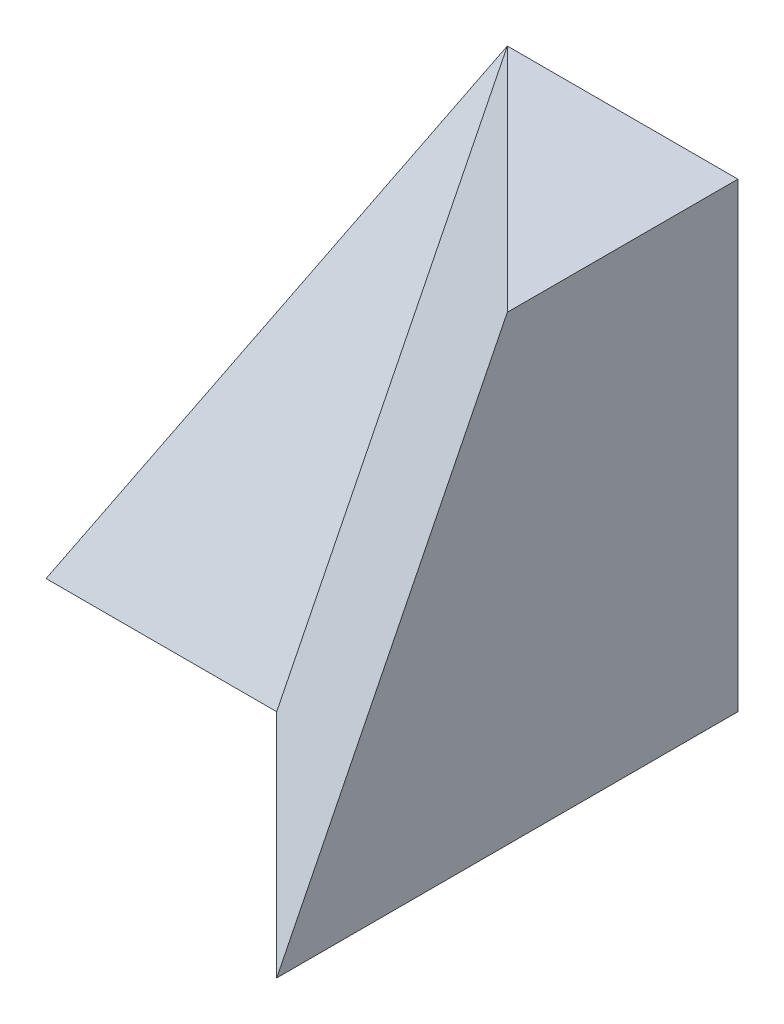
ISO-10303-21;
HEADER;
FILE_DESCRIPTION(('STEP AP214'),'2;1');
FILE_NAME('part.step','',(''),(''),'','','');
FILE_SCHEMA(('AUTOMOTIVE_DESIGN { 1 0 10303 214 1 1 1 1 }'));
ENDSEC;
DATA;
#1=APPLICATION_CONTEXT('core data for automotive mechanical design processes');
#2=APPLICATION_PROTOCOL_DEFINITION('international standard','automotive_design',2000,#1);
#3=PRODUCT_CONTEXT('',#1,'mechanical');
#4=PRODUCT('Part','Part','',(#3));
#5=PRODUCT_RELATED_PRODUCT_CATEGORY('part','',(#4));
#6=PRODUCT_DEFINITION_FORMATION('','',#4);
#7=PRODUCT_DEFINITION_CONTEXT('part definition',#1,'design');
#8=PRODUCT_DEFINITION('design','',#6,#7);
#9=PRODUCT_DEFINITION_SHAPE('','',#8);
#10=(LENGTH_UNIT() NAMED_UNIT(*) SI_UNIT(.MILLI.,.METRE.));
#11=(NAMED_UNIT(*) PLANE_ANGLE_UNIT() SI_UNIT($,.RADIAN.));
#12=(NAMED_UNIT(*) SI_UNIT($,.STERADIAN.) SOLID_ANGLE_UNIT());
#13=UNCERTAINTY_MEASURE_WITH_UNIT(LENGTH_MEASURE(1.E-05),#10,'distance_accuracy_value','');
#14=(GEOMETRIC_REPRESENTATION_CONTEXT(3) GLOBAL_UNCERTAINTY_ASSIGNED_CONTEXT((#13)) GLOBAL_UNIT_ASSIGNED_CONTEXT((#10,
#11,#12)) REPRESENTATION_CONTEXT('',''));
#15=CARTESIAN_POINT('',(0.,0.,0.));
#16=DIRECTION('',(0.,0.,1.));
#17=DIRECTION('',(1.,0.,0.));
#18=AXIS2_PLACEMENT_3D('',#15,#16,#17);
#19=CARTESIAN_POINT('',(0.,40.,40.));
#20=DIRECTION('',(0.,-1.,0.));
#21=DIRECTION('',(0.,0.,-1.));
#22=AXIS2_PLACEMENT_3D('',#19,#20,#21);
#23=PLANE('',#22);
#24=DIRECTION('',(0.707106781186547,0.,0.707106781186548));
#25=VECTOR('',#24,1.);
#26=CARTESIAN_POINT('',(40.,40.,20.));
#27=LINE('',#26,#25);
#28=CARTESIAN_POINT('',(20.,40.,0.));
#29=VERTEX_POINT('',#28);
#30=CARTESIAN_POINT('',(40.,40.,20.));
#31=VERTEX_POINT('',#30);
#32=EDGE_CURVE('E71',#29,#31,#27,.T.);
#33=ORIENTED_EDGE('',*,*,#32,.T.);
#34=DIRECTION('',(0.,0.,-1.));
#35=VECTOR('',#34,1.);
#36=CARTESIAN_POINT('',(40.,40.,40.));
#37=LINE('',#36,#35);
#38=CARTESIAN_POINT('',(40.,40.,0.));
#39=VERTEX_POINT('',#38);
#40=EDGE_CURVE('E37',#31,#39,#37,.T.);
#41=ORIENTED_EDGE('',*,*,#40,.T.);
#42=DIRECTION('',(-1.,0.,0.));
#43=VECTOR('',#42,1.);
#44=CARTESIAN_POINT('',(20.,40.,0.));
#45=LINE('',#44,#43);
#46=EDGE_CURVE('E85',#39,#29,#45,.T.);
#47=ORIENTED_EDGE('',*,*,#46,.T.);
#48=EDGE_LOOP('',(#33,#41,#47));
#49=FACE_BOUND('',#48,.T.);
#50=ADVANCED_FACE('F33',(#49),#23,.F.);
#51=CARTESIAN_POINT('',(0.,0.,0.));
#52=DIRECTION('',(0.894427190999916,-0.447213595499958,0.));
#53=DIRECTION('',(0.447213595499958,0.894427190999916,0.));
#54=AXIS2_PLACEMENT_3D('',#51,#52,#53);
#55=PLANE('',#54);
#56=DIRECTION('',(0.408248290463863,0.816496580927726,-0.408248290463863));
#57=VECTOR('',#56,1.);
#58=CARTESIAN_POINT('',(0.,0.,20.));
#59=LINE('',#58,#57);
#60=CARTESIAN_POINT('',(0.,0.,20.));
#61=VERTEX_POINT('',#60);
#62=EDGE_CURVE('E87',#61,#29,#59,.T.);
#63=ORIENTED_EDGE('',*,*,#62,.T.);
#64=DIRECTION('',(0.447213595499958,0.894427190999916,0.));
#65=VECTOR('',#64,1.);
#66=CARTESIAN_POINT('',(0.,0.,0.));
#67=LINE('',#66,#65);
#68=CARTESIAN_POINT('',(0.,0.,0.));
#69=VERTEX_POINT('',#68);
#70=EDGE_CURVE('E96',#69,#29,#67,.T.);
#71=ORIENTED_EDGE('',*,*,#70,.F.);
#72=DIRECTION('',(0.,0.,-1.));
#73=VECTOR('',#72,1.);
#74=CARTESIAN_POINT('',(0.,0.,40.));
#75=LINE('',#74,#73);
#76=EDGE_CURVE('E90',#61,#69,#75,.T.);
#77=ORIENTED_EDGE('',*,*,#76,.F.);
#78=EDGE_LOOP('',(#63,#71,#77));
#79=FACE_BOUND('',#78,.T.);
#80=ADVANCED_FACE('F109',(#79),#55,.F.);
#81=CARTESIAN_POINT('',(0.,0.,40.));
#82=DIRECTION('',(0.,1.,0.));
#83=DIRECTION('',(0.,0.,1.));
#84=AXIS2_PLACEMENT_3D('',#81,#82,#83);
#85=PLANE('',#84);
#86=DIRECTION('',(0.,0.,-1.));
#87=VECTOR('',#86,1.);
#88=CARTESIAN_POINT('',(40.,0.,40.));
#89=LINE('',#88,#87);
#90=CARTESIAN_POINT('',(40.,0.,40.));
#91=VERTEX_POINT('',#90);
#92=CARTESIAN_POINT('',(40.,0.,0.));
#93=VERTEX_POINT('',#92);
#94=EDGE_CURVE('E76',#91,#93,#89,.T.);
#95=ORIENTED_EDGE('',*,*,#94,.F.);
#96=DIRECTION('',(0.707106781186547,0.,0.707106781186548));
#97=VECTOR('',#96,1.);
#98=CARTESIAN_POINT('',(20.,0.,20.));
#99=LINE('',#98,#97);
#100=CARTESIAN_POINT('',(20.,0.,20.));
#101=VERTEX_POINT('',#100);
#102=EDGE_CURVE('E11',#101,#91,#99,.T.);
#103=ORIENTED_EDGE('',*,*,#102,.F.);
#104=DIRECTION('',(1.,0.,0.));
#105=VECTOR('',#104,1.);
#106=CARTESIAN_POINT('',(0.,0.,20.));
#107=LINE('',#106,#105);
#108=EDGE_CURVE('E92',#61,#101,#107,.T.);
#109=ORIENTED_EDGE('',*,*,#108,.F.);
#110=ORIENTED_EDGE('',*,*,#76,.T.);
#111=DIRECTION('',(1.,0.,0.));
#112=VECTOR('',#111,1.);
#113=CARTESIAN_POINT('',(0.,0.,0.));
#114=LINE('',#113,#112);
#115=EDGE_CURVE('E77',#69,#93,#114,.T.);
#116=ORIENTED_EDGE('',*,*,#115,.T.);
#117=EDGE_LOOP('',(#95,#103,#109,#110,#116));
#118=FACE_BOUND('',#117,.T.);
#119=ADVANCED_FACE('F106',(#118),#85,.F.);
#120=CARTESIAN_POINT('',(40.,0.,40.));
#121=DIRECTION('',(-1.,0.,0.));
#122=DIRECTION('',(0.,0.,1.));
#123=AXIS2_PLACEMENT_3D('',#120,#121,#122);
#124=PLANE('',#123);
#125=ORIENTED_EDGE('',*,*,#40,.F.);
#126=DIRECTION('',(0.,-0.894427190999916,0.447213595499958));
#127=VECTOR('',#126,1.);
#128=CARTESIAN_POINT('',(40.,0.,40.));
#129=LINE('',#128,#127);
#130=EDGE_CURVE('E67',#31,#91,#129,.T.);
#131=ORIENTED_EDGE('',*,*,#130,.T.);
#132=ORIENTED_EDGE('',*,*,#94,.T.);
#133=DIRECTION('',(0.,1.,0.));
#134=VECTOR('',#133,1.);
#135=CARTESIAN_POINT('',(40.,0.,0.));
#136=LINE('',#135,#134);
#137=EDGE_CURVE('E81',#93,#39,#136,.T.);
#138=ORIENTED_EDGE('',*,*,#137,.T.);
#139=EDGE_LOOP('',(#125,#131,#132,#138));
#140=FACE_BOUND('',#139,.T.);
#141=ADVANCED_FACE('F35',(#140),#124,.F.);
#142=CARTESIAN_POINT('',(0.,0.,0.));
#143=DIRECTION('',(0.,0.,-1.));
#144=DIRECTION('',(-1.,0.,0.));
#145=AXIS2_PLACEMENT_3D('',#142,#143,#144);
#146=PLANE('',#145);
#147=ORIENTED_EDGE('',*,*,#70,.T.);
#148=ORIENTED_EDGE('',*,*,#46,.F.);
#149=ORIENTED_EDGE('',*,*,#137,.F.);
#150=ORIENTED_EDGE('',*,*,#115,.F.);
#151=EDGE_LOOP('',(#147,#148,#149,#150));
#152=FACE_BOUND('',#151,.T.);
#153=ADVANCED_FACE('F111',(#152),#146,.T.);
#154=CARTESIAN_POINT('',(0.,8.,16.));
#155=DIRECTION('',(0.,0.447213595499958,0.894427190999916));
#156=DIRECTION('',(0.,-0.894427190999916,0.447213595499958));
#157=AXIS2_PLACEMENT_3D('',#154,#155,#156);
#158=PLANE('',#157);
#159=ORIENTED_EDGE('',*,*,#108,.T.);
#160=DIRECTION('',(0.,-0.894427190999916,0.447213595499958));
#161=VECTOR('',#160,1.);
#162=CARTESIAN_POINT('',(20.,40.,0.));
#163=LINE('',#162,#161);
#164=EDGE_CURVE('E43',#29,#101,#163,.T.);
#165=ORIENTED_EDGE('',*,*,#164,.F.);
#166=ORIENTED_EDGE('',*,*,#62,.F.);
#167=EDGE_LOOP('',(#159,#165,#166));
#168=FACE_BOUND('',#167,.T.);
#169=ADVANCED_FACE('F113',(#168),#158,.T.);
#170=CARTESIAN_POINT('',(0.,0.,0.));
#171=DIRECTION('',(-0.666666666666667,0.333333333333333,0.666666666666667));
#172=DIRECTION('',(0.707106781186547,0.,0.707106781186548));
#173=AXIS2_PLACEMENT_3D('',#170,#171,#172);
#174=PLANE('',#173);
#175=ORIENTED_EDGE('',*,*,#32,.F.);
#176=ORIENTED_EDGE('',*,*,#164,.T.);
#177=ORIENTED_EDGE('',*,*,#102,.T.);
#178=ORIENTED_EDGE('',*,*,#130,.F.);
#179=EDGE_LOOP('',(#175,#176,#177,#178));
#180=FACE_BOUND('',#179,.T.);
#181=ADVANCED_FACE('F69',(#180),#174,.T.);
#182=CLOSED_SHELL('',(#50,#80,#119,#141,#153,#169,#181));
#183=MANIFOLD_SOLID_BREP('B2',#182);
#184=ADVANCED_BREP_SHAPE_REPRESENTATION('',(#18,#183),#14);
#185=SHAPE_DEFINITION_REPRESENTATION(#9,#184);
ENDSEC;
END-ISO-10303-21;
